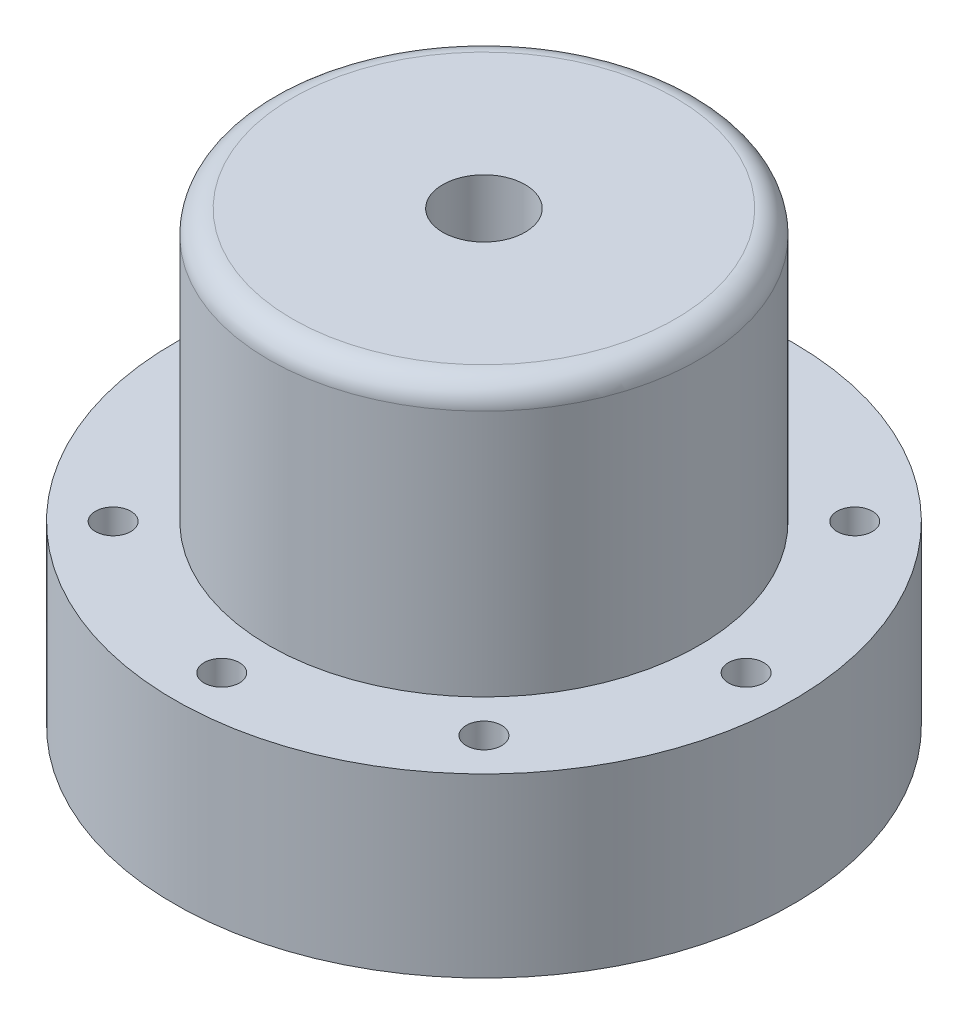
ISO-10303-21;
HEADER;
FILE_DESCRIPTION(('STEP AP214'),'2;1');
FILE_NAME('part.step','',(''),(''),'','','');
FILE_SCHEMA(('AUTOMOTIVE_DESIGN { 1 0 10303 214 1 1 1 1 }'));
ENDSEC;
DATA;
#1=APPLICATION_CONTEXT('core data for automotive mechanical design processes');
#2=APPLICATION_PROTOCOL_DEFINITION('international standard','automotive_design',2000,#1);
#3=PRODUCT_CONTEXT('',#1,'mechanical');
#4=PRODUCT('Part','Part','',(#3));
#5=PRODUCT_RELATED_PRODUCT_CATEGORY('part','',(#4));
#6=PRODUCT_DEFINITION_FORMATION('','',#4);
#7=PRODUCT_DEFINITION_CONTEXT('part definition',#1,'design');
#8=PRODUCT_DEFINITION('design','',#6,#7);
#9=PRODUCT_DEFINITION_SHAPE('','',#8);
#10=(LENGTH_UNIT() NAMED_UNIT(*) SI_UNIT(.MILLI.,.METRE.));
#11=(NAMED_UNIT(*) PLANE_ANGLE_UNIT() SI_UNIT($,.RADIAN.));
#12=(NAMED_UNIT(*) SI_UNIT($,.STERADIAN.) SOLID_ANGLE_UNIT());
#13=UNCERTAINTY_MEASURE_WITH_UNIT(LENGTH_MEASURE(1.E-05),#10,'distance_accuracy_value','');
#14=(GEOMETRIC_REPRESENTATION_CONTEXT(3) GLOBAL_UNCERTAINTY_ASSIGNED_CONTEXT((#13)) GLOBAL_UNIT_ASSIGNED_CONTEXT((#10,
#11,#12)) REPRESENTATION_CONTEXT('',''));
#15=CARTESIAN_POINT('',(0.,0.,0.));
#16=DIRECTION('',(0.,0.,1.));
#17=DIRECTION('',(1.,0.,0.));
#18=AXIS2_PLACEMENT_3D('',#15,#16,#17);
#19=CARTESIAN_POINT('',(0.,-5.,0.));
#20=DIRECTION('',(0.,-1.,0.));
#21=DIRECTION('',(0.,0.,-1.));
#22=AXIS2_PLACEMENT_3D('',#19,#20,#21);
#23=PLANE('',#22);
#24=CARTESIAN_POINT('',(0.,-5.,0.));
#25=DIRECTION('',(0.,-1.,0.));
#26=DIRECTION('',(0.,0.,-1.));
#27=AXIS2_PLACEMENT_3D('',#24,#25,#26);
#28=CIRCLE('',#27,13.25);
#29=CARTESIAN_POINT('',(0.,-5.,-13.25));
#30=VERTEX_POINT('',#29);
#31=EDGE_CURVE('E58',#30,#30,#28,.T.);
#32=ORIENTED_EDGE('',*,*,#31,.F.);
#33=EDGE_LOOP('',(#32));
#34=FACE_BOUND('',#33,.T.);
#35=CARTESIAN_POINT('',(0.,-5.,0.));
#36=DIRECTION('',(0.,-1.,0.));
#37=DIRECTION('',(0.,0.,-1.));
#38=AXIS2_PLACEMENT_3D('',#35,#36,#37);
#39=CIRCLE('',#38,19.25);
#40=CARTESIAN_POINT('',(0.,-5.,-19.25));
#41=VERTEX_POINT('',#40);
#42=EDGE_CURVE('E90',#41,#41,#39,.T.);
#43=ORIENTED_EDGE('',*,*,#42,.T.);
#44=EDGE_LOOP('',(#43));
#45=FACE_BOUND('',#44,.T.);
#46=ADVANCED_FACE('F33',(#34,#45),#23,.T.);
#47=CARTESIAN_POINT('',(0.,18.,0.));
#48=DIRECTION('',(0.,-1.,0.));
#49=DIRECTION('',(0.,0.,-1.));
#50=AXIS2_PLACEMENT_3D('',#47,#48,#49);
#51=CYLINDRICAL_SURFACE('',#50,18.25);
#52=CARTESIAN_POINT('',(0.,21.,0.));
#53=DIRECTION('',(0.,1.,0.));
#54=DIRECTION('',(0.,0.,1.));
#55=AXIS2_PLACEMENT_3D('',#52,#53,#54);
#56=CIRCLE('',#55,18.25);
#57=CARTESIAN_POINT('',(0.,21.,18.25));
#58=VERTEX_POINT('',#57);
#59=EDGE_CURVE('E10',#58,#58,#56,.F.);
#60=ORIENTED_EDGE('',*,*,#59,.T.);
#61=EDGE_LOOP('',(#60));
#62=FACE_BOUND('',#61,.T.);
#63=CARTESIAN_POINT('',(0.,0.,0.));
#64=DIRECTION('',(0.,1.,0.));
#65=DIRECTION('',(0.,0.,1.));
#66=AXIS2_PLACEMENT_3D('',#63,#64,#65);
#67=CIRCLE('',#66,18.25);
#68=CARTESIAN_POINT('',(0.,0.,18.25));
#69=VERTEX_POINT('',#68);
#70=EDGE_CURVE('E44',#69,#69,#67,.T.);
#71=ORIENTED_EDGE('',*,*,#70,.T.);
#72=EDGE_LOOP('',(#71));
#73=FACE_BOUND('',#72,.T.);
#74=ADVANCED_FACE('F166',(#62,#73),#51,.T.);
#75=CARTESIAN_POINT('',(0.,18.,0.));
#76=DIRECTION('',(0.,-1.,0.));
#77=DIRECTION('',(0.,0.,-1.));
#78=AXIS2_PLACEMENT_3D('',#75,#76,#77);
#79=CYLINDRICAL_SURFACE('',#78,13.25);
#80=CARTESIAN_POINT('',(0.,18.,0.));
#81=DIRECTION('',(0.,1.,0.));
#82=DIRECTION('',(0.,0.,1.));
#83=AXIS2_PLACEMENT_3D('',#80,#81,#82);
#84=CIRCLE('',#83,13.25);
#85=CARTESIAN_POINT('',(0.,18.,13.25));
#86=VERTEX_POINT('',#85);
#87=EDGE_CURVE('E51',#86,#86,#84,.T.);
#88=ORIENTED_EDGE('',*,*,#87,.T.);
#89=EDGE_LOOP('',(#88));
#90=FACE_BOUND('',#89,.T.);
#91=ORIENTED_EDGE('',*,*,#31,.T.);
#92=EDGE_LOOP('',(#91));
#93=FACE_BOUND('',#92,.T.);
#94=ADVANCED_FACE('F172',(#90,#93),#79,.F.);
#95=CARTESIAN_POINT('',(0.,0.,0.));
#96=DIRECTION('',(0.,-1.,0.));
#97=DIRECTION('',(0.,0.,-1.));
#98=AXIS2_PLACEMENT_3D('',#95,#96,#97);
#99=PLANE('',#98);
#100=CARTESIAN_POINT('',(-22.25,0.,0.));
#101=DIRECTION('',(0.,1.,0.));
#102=DIRECTION('',(-1.,0.,0.));
#103=AXIS2_PLACEMENT_3D('',#100,#101,#102);
#104=CIRCLE('',#103,1.5);
#105=CARTESIAN_POINT('',(-23.75,0.,0.));
#106=VERTEX_POINT('',#105);
#107=EDGE_CURVE('E67',#106,#106,#104,.T.);
#108=ORIENTED_EDGE('',*,*,#107,.F.);
#109=EDGE_LOOP('',(#108));
#110=FACE_BOUND('',#109,.T.);
#111=CARTESIAN_POINT('',(-15.7331258814006,0.,-15.7331258814008));
#112=DIRECTION('',(0.,1.,0.));
#113=DIRECTION('',(-0.707106781186544,0.,-0.707106781186551));
#114=AXIS2_PLACEMENT_3D('',#111,#112,#113);
#115=CIRCLE('',#114,1.5);
#116=CARTESIAN_POINT('',(-16.7937860531804,0.,-16.7937860531806));
#117=VERTEX_POINT('',#116);
#118=EDGE_CURVE('E75',#117,#117,#115,.T.);
#119=ORIENTED_EDGE('',*,*,#118,.F.);
#120=EDGE_LOOP('',(#119));
#121=FACE_BOUND('',#120,.T.);
#122=CARTESIAN_POINT('',(0.,0.,-22.25));
#123=DIRECTION('',(0.,1.,0.));
#124=DIRECTION('',(0.,0.,-1.));
#125=AXIS2_PLACEMENT_3D('',#122,#123,#124);
#126=CIRCLE('',#125,1.5);
#127=CARTESIAN_POINT('',(0.,0.,-23.75));
#128=VERTEX_POINT('',#127);
#129=EDGE_CURVE('E71',#128,#128,#126,.T.);
#130=ORIENTED_EDGE('',*,*,#129,.F.);
#131=EDGE_LOOP('',(#130));
#132=FACE_BOUND('',#131,.T.);
#133=CARTESIAN_POINT('',(15.7331258814008,0.,-15.7331258814005));
#134=DIRECTION('',(0.,1.,0.));
#135=DIRECTION('',(0.707106781186554,0.,-0.707106781186541));
#136=AXIS2_PLACEMENT_3D('',#133,#134,#135);
#137=CIRCLE('',#136,1.5);
#138=CARTESIAN_POINT('',(16.7937860531806,0.,-16.7937860531804));
#139=VERTEX_POINT('',#138);
#140=EDGE_CURVE('E68',#139,#139,#137,.T.);
#141=ORIENTED_EDGE('',*,*,#140,.F.);
#142=EDGE_LOOP('',(#141));
#143=FACE_BOUND('',#142,.T.);
#144=CARTESIAN_POINT('',(22.25,0.,2.32950203201339E-13));
#145=DIRECTION('',(0.,1.,0.));
#146=DIRECTION('',(1.,0.,0.));
#147=AXIS2_PLACEMENT_3D('',#144,#145,#146);
#148=CIRCLE('',#147,1.5);
#149=CARTESIAN_POINT('',(23.75,0.,2.48661869226133E-13));
#150=VERTEX_POINT('',#149);
#151=EDGE_CURVE('E72',#150,#150,#148,.T.);
#152=ORIENTED_EDGE('',*,*,#151,.F.);
#153=EDGE_LOOP('',(#152));
#154=FACE_BOUND('',#153,.T.);
#155=CARTESIAN_POINT('',(15.7331258814005,0.,15.7331258814009));
#156=DIRECTION('',(0.,1.,0.));
#157=DIRECTION('',(0.707106781186539,0.,0.707106781186556));
#158=AXIS2_PLACEMENT_3D('',#155,#156,#157);
#159=CIRCLE('',#158,1.5);
#160=CARTESIAN_POINT('',(16.7937860531803,0.,16.7937860531807));
#161=VERTEX_POINT('',#160);
#162=EDGE_CURVE('E54',#161,#161,#159,.T.);
#163=ORIENTED_EDGE('',*,*,#162,.F.);
#164=EDGE_LOOP('',(#163));
#165=FACE_BOUND('',#164,.T.);
#166=CARTESIAN_POINT('',(-15.7331258814007,0.,15.7331258814007));
#167=DIRECTION('',(0.,1.,0.));
#168=DIRECTION('',(-0.707106781186549,0.,0.707106781186546));
#169=AXIS2_PLACEMENT_3D('',#166,#167,#168);
#170=CIRCLE('',#169,1.5);
#171=CARTESIAN_POINT('',(-16.7937860531805,0.,16.7937860531805));
#172=VERTEX_POINT('',#171);
#173=EDGE_CURVE('E64',#172,#172,#170,.T.);
#174=ORIENTED_EDGE('',*,*,#173,.F.);
#175=EDGE_LOOP('',(#174));
#176=FACE_BOUND('',#175,.T.);
#177=CARTESIAN_POINT('',(0.,0.,22.25));
#178=DIRECTION('',(0.,1.,0.));
#179=DIRECTION('',(0.,0.,1.));
#180=AXIS2_PLACEMENT_3D('',#177,#178,#179);
#181=CIRCLE('',#180,1.5);
#182=CARTESIAN_POINT('',(0.,0.,23.75));
#183=VERTEX_POINT('',#182);
#184=EDGE_CURVE('E61',#183,#183,#181,.T.);
#185=ORIENTED_EDGE('',*,*,#184,.F.);
#186=EDGE_LOOP('',(#185));
#187=FACE_BOUND('',#186,.T.);
#188=ORIENTED_EDGE('',*,*,#70,.F.);
#189=EDGE_LOOP('',(#188));
#190=FACE_BOUND('',#189,.T.);
#191=CARTESIAN_POINT('',(0.,0.,0.));
#192=DIRECTION('',(0.,-1.,0.));
#193=DIRECTION('',(0.,0.,-1.));
#194=AXIS2_PLACEMENT_3D('',#191,#192,#193);
#195=CIRCLE('',#194,26.25);
#196=CARTESIAN_POINT('',(0.,0.,-26.25));
#197=VERTEX_POINT('',#196);
#198=EDGE_CURVE('E48',#197,#197,#195,.T.);
#199=ORIENTED_EDGE('',*,*,#198,.F.);
#200=EDGE_LOOP('',(#199));
#201=FACE_BOUND('',#200,.T.);
#202=ADVANCED_FACE('F179',(#110,#121,#132,#143,#154,#165,#176,#187,#190,#201),#99,.F.);
#203=CARTESIAN_POINT('',(0.,-5.,0.));
#204=DIRECTION('',(0.,1.,0.));
#205=DIRECTION('',(0.,0.,1.));
#206=AXIS2_PLACEMENT_3D('',#203,#204,#205);
#207=CYLINDRICAL_SURFACE('',#206,26.25);
#208=ORIENTED_EDGE('',*,*,#198,.T.);
#209=EDGE_LOOP('',(#208));
#210=FACE_BOUND('',#209,.T.);
#211=CARTESIAN_POINT('',(0.,-15.,0.));
#212=DIRECTION('',(0.,-1.,0.));
#213=DIRECTION('',(0.,0.,-1.));
#214=AXIS2_PLACEMENT_3D('',#211,#212,#213);
#215=CIRCLE('',#214,26.25);
#216=CARTESIAN_POINT('',(0.,-15.,-26.25));
#217=VERTEX_POINT('',#216);
#218=EDGE_CURVE('E105',#217,#217,#215,.T.);
#219=ORIENTED_EDGE('',*,*,#218,.F.);
#220=EDGE_LOOP('',(#219));
#221=FACE_BOUND('',#220,.T.);
#222=ADVANCED_FACE('F182',(#210,#221),#207,.T.);
#223=CARTESIAN_POINT('',(0.,-5.001,22.25));
#224=DIRECTION('',(0.,1.,0.));
#225=DIRECTION('',(0.,0.,1.));
#226=AXIS2_PLACEMENT_3D('',#223,#224,#225);
#227=CYLINDRICAL_SURFACE('',#226,1.5);
#228=ORIENTED_EDGE('',*,*,#184,.T.);
#229=EDGE_LOOP('',(#228));
#230=FACE_BOUND('',#229,.T.);
#231=CARTESIAN_POINT('',(0.,-15.,22.25));
#232=DIRECTION('',(0.,-1.,0.));
#233=DIRECTION('',(0.,0.,-1.));
#234=AXIS2_PLACEMENT_3D('',#231,#232,#233);
#235=CIRCLE('',#234,1.5);
#236=CARTESIAN_POINT('',(0.,-15.,20.75));
#237=VERTEX_POINT('',#236);
#238=EDGE_CURVE('E108',#237,#237,#235,.F.);
#239=ORIENTED_EDGE('',*,*,#238,.F.);
#240=EDGE_LOOP('',(#239));
#241=FACE_BOUND('',#240,.T.);
#242=ADVANCED_FACE('F177',(#230,#241),#227,.F.);
#243=CARTESIAN_POINT('',(-15.7331258814007,-5.001,15.7331258814007));
#244=DIRECTION('',(0.,1.,0.));
#245=DIRECTION('',(0.,0.,1.));
#246=AXIS2_PLACEMENT_3D('',#243,#244,#245);
#247=CYLINDRICAL_SURFACE('',#246,1.5);
#248=ORIENTED_EDGE('',*,*,#173,.T.);
#249=EDGE_LOOP('',(#248));
#250=FACE_BOUND('',#249,.T.);
#251=CARTESIAN_POINT('',(-15.7331258814007,-15.,15.7331258814007));
#252=DIRECTION('',(0.,-1.,0.));
#253=DIRECTION('',(0.,0.,-1.));
#254=AXIS2_PLACEMENT_3D('',#251,#252,#253);
#255=CIRCLE('',#254,1.5);
#256=CARTESIAN_POINT('',(-15.7331258814007,-15.,14.2331258814007));
#257=VERTEX_POINT('',#256);
#258=EDGE_CURVE('E102',#257,#257,#255,.F.);
#259=ORIENTED_EDGE('',*,*,#258,.F.);
#260=EDGE_LOOP('',(#259));
#261=FACE_BOUND('',#260,.T.);
#262=ADVANCED_FACE('F211',(#250,#261),#247,.F.);
#263=CARTESIAN_POINT('',(15.7331258814005,-5.001,15.7331258814009));
#264=DIRECTION('',(0.,1.,0.));
#265=DIRECTION('',(0.,0.,1.));
#266=AXIS2_PLACEMENT_3D('',#263,#264,#265);
#267=CYLINDRICAL_SURFACE('',#266,1.5);
#268=ORIENTED_EDGE('',*,*,#162,.T.);
#269=EDGE_LOOP('',(#268));
#270=FACE_BOUND('',#269,.T.);
#271=CARTESIAN_POINT('',(15.7331258814005,-15.,15.7331258814009));
#272=DIRECTION('',(0.,-1.,0.));
#273=DIRECTION('',(0.,0.,-1.));
#274=AXIS2_PLACEMENT_3D('',#271,#272,#273);
#275=CIRCLE('',#274,1.5);
#276=CARTESIAN_POINT('',(15.7331258814005,-15.,14.2331258814009));
#277=VERTEX_POINT('',#276);
#278=EDGE_CURVE('E111',#277,#277,#275,.F.);
#279=ORIENTED_EDGE('',*,*,#278,.F.);
#280=EDGE_LOOP('',(#279));
#281=FACE_BOUND('',#280,.T.);
#282=ADVANCED_FACE('F218',(#270,#281),#267,.F.);
#283=CARTESIAN_POINT('',(22.25,-5.001,2.32950203201339E-13));
#284=DIRECTION('',(0.,1.,0.));
#285=DIRECTION('',(0.,0.,1.));
#286=AXIS2_PLACEMENT_3D('',#283,#284,#285);
#287=CYLINDRICAL_SURFACE('',#286,1.5);
#288=ORIENTED_EDGE('',*,*,#151,.T.);
#289=EDGE_LOOP('',(#288));
#290=FACE_BOUND('',#289,.T.);
#291=CARTESIAN_POINT('',(22.25,-15.,2.32950203201339E-13));
#292=DIRECTION('',(0.,-1.,0.));
#293=DIRECTION('',(0.,0.,-1.));
#294=AXIS2_PLACEMENT_3D('',#291,#292,#293);
#295=CIRCLE('',#294,1.5);
#296=CARTESIAN_POINT('',(22.25,-15.,-1.49999999999977));
#297=VERTEX_POINT('',#296);
#298=EDGE_CURVE('E99',#297,#297,#295,.F.);
#299=ORIENTED_EDGE('',*,*,#298,.F.);
#300=EDGE_LOOP('',(#299));
#301=FACE_BOUND('',#300,.T.);
#302=ADVANCED_FACE('F225',(#290,#301),#287,.F.);
#303=CARTESIAN_POINT('',(15.7331258814008,-5.001,-15.7331258814005));
#304=DIRECTION('',(0.,1.,0.));
#305=DIRECTION('',(0.,0.,1.));
#306=AXIS2_PLACEMENT_3D('',#303,#304,#305);
#307=CYLINDRICAL_SURFACE('',#306,1.5);
#308=ORIENTED_EDGE('',*,*,#140,.T.);
#309=EDGE_LOOP('',(#308));
#310=FACE_BOUND('',#309,.T.);
#311=CARTESIAN_POINT('',(15.7331258814008,-15.,-15.7331258814005));
#312=DIRECTION('',(0.,-1.,0.));
#313=DIRECTION('',(0.,0.,-1.));
#314=AXIS2_PLACEMENT_3D('',#311,#312,#313);
#315=CIRCLE('',#314,1.5);
#316=CARTESIAN_POINT('',(15.7331258814008,-15.,-17.2331258814005));
#317=VERTEX_POINT('',#316);
#318=EDGE_CURVE('E114',#317,#317,#315,.F.);
#319=ORIENTED_EDGE('',*,*,#318,.F.);
#320=EDGE_LOOP('',(#319));
#321=FACE_BOUND('',#320,.T.);
#322=ADVANCED_FACE('F232',(#310,#321),#307,.F.);
#323=CARTESIAN_POINT('',(0.,-5.001,-22.25));
#324=DIRECTION('',(0.,1.,0.));
#325=DIRECTION('',(0.,0.,1.));
#326=AXIS2_PLACEMENT_3D('',#323,#324,#325);
#327=CYLINDRICAL_SURFACE('',#326,1.5);
#328=ORIENTED_EDGE('',*,*,#129,.T.);
#329=EDGE_LOOP('',(#328));
#330=FACE_BOUND('',#329,.T.);
#331=CARTESIAN_POINT('',(0.,-15.,-22.25));
#332=DIRECTION('',(0.,-1.,0.));
#333=DIRECTION('',(0.,0.,-1.));
#334=AXIS2_PLACEMENT_3D('',#331,#332,#333);
#335=CIRCLE('',#334,1.5);
#336=CARTESIAN_POINT('',(0.,-15.,-23.75));
#337=VERTEX_POINT('',#336);
#338=EDGE_CURVE('E96',#337,#337,#335,.F.);
#339=ORIENTED_EDGE('',*,*,#338,.F.);
#340=EDGE_LOOP('',(#339));
#341=FACE_BOUND('',#340,.T.);
#342=ADVANCED_FACE('F161',(#330,#341),#327,.F.);
#343=CARTESIAN_POINT('',(-15.7331258814006,-5.001,-15.7331258814008));
#344=DIRECTION('',(0.,1.,0.));
#345=DIRECTION('',(0.,0.,1.));
#346=AXIS2_PLACEMENT_3D('',#343,#344,#345);
#347=CYLINDRICAL_SURFACE('',#346,1.5);
#348=ORIENTED_EDGE('',*,*,#118,.T.);
#349=EDGE_LOOP('',(#348));
#350=FACE_BOUND('',#349,.T.);
#351=CARTESIAN_POINT('',(-15.7331258814006,-15.,-15.7331258814008));
#352=DIRECTION('',(0.,-1.,0.));
#353=DIRECTION('',(0.,0.,-1.));
#354=AXIS2_PLACEMENT_3D('',#351,#352,#353);
#355=CIRCLE('',#354,1.5);
#356=CARTESIAN_POINT('',(-15.7331258814006,-15.,-17.2331258814008));
#357=VERTEX_POINT('',#356);
#358=EDGE_CURVE('E117',#357,#357,#355,.F.);
#359=ORIENTED_EDGE('',*,*,#358,.F.);
#360=EDGE_LOOP('',(#359));
#361=FACE_BOUND('',#360,.T.);
#362=ADVANCED_FACE('F151',(#350,#361),#347,.F.);
#363=CARTESIAN_POINT('',(-22.25,-5.001,0.));
#364=DIRECTION('',(0.,1.,0.));
#365=DIRECTION('',(0.,0.,1.));
#366=AXIS2_PLACEMENT_3D('',#363,#364,#365);
#367=CYLINDRICAL_SURFACE('',#366,1.5);
#368=ORIENTED_EDGE('',*,*,#107,.T.);
#369=EDGE_LOOP('',(#368));
#370=FACE_BOUND('',#369,.T.);
#371=CARTESIAN_POINT('',(-22.25,-15.,0.));
#372=DIRECTION('',(0.,-1.,0.));
#373=DIRECTION('',(0.,0.,-1.));
#374=AXIS2_PLACEMENT_3D('',#371,#372,#373);
#375=CIRCLE('',#374,1.5);
#376=CARTESIAN_POINT('',(-22.25,-15.,-1.50000000000008));
#377=VERTEX_POINT('',#376);
#378=EDGE_CURVE('E87',#377,#377,#375,.F.);
#379=ORIENTED_EDGE('',*,*,#378,.F.);
#380=EDGE_LOOP('',(#379));
#381=FACE_BOUND('',#380,.T.);
#382=ADVANCED_FACE('F148',(#370,#381),#367,.F.);
#383=CARTESIAN_POINT('',(0.,18.,0.));
#384=DIRECTION('',(0.,1.,0.));
#385=DIRECTION('',(0.,0.,1.));
#386=AXIS2_PLACEMENT_3D('',#383,#384,#385);
#387=PLANE('',#386);
#388=CARTESIAN_POINT('',(0.,18.,0.));
#389=DIRECTION('',(0.,1.,0.));
#390=DIRECTION('',(0.,0.,1.));
#391=AXIS2_PLACEMENT_3D('',#388,#389,#390);
#392=CIRCLE('',#391,3.5);
#393=CARTESIAN_POINT('',(0.,18.,3.5));
#394=VERTEX_POINT('',#393);
#395=EDGE_CURVE('E84',#394,#394,#392,.T.);
#396=ORIENTED_EDGE('',*,*,#395,.T.);
#397=EDGE_LOOP('',(#396));
#398=FACE_BOUND('',#397,.T.);
#399=ORIENTED_EDGE('',*,*,#87,.F.);
#400=EDGE_LOOP('',(#399));
#401=FACE_BOUND('',#400,.T.);
#402=ADVANCED_FACE('F150',(#398,#401),#387,.F.);
#403=CARTESIAN_POINT('',(0.,23.,0.));
#404=DIRECTION('',(0.,1.,0.));
#405=DIRECTION('',(0.,0.,1.));
#406=AXIS2_PLACEMENT_3D('',#403,#404,#405);
#407=PLANE('',#406);
#408=CARTESIAN_POINT('',(0.,23.,0.));
#409=DIRECTION('',(0.,1.,0.));
#410=DIRECTION('',(0.,0.,1.));
#411=AXIS2_PLACEMENT_3D('',#408,#409,#410);
#412=CIRCLE('',#411,16.25);
#413=CARTESIAN_POINT('',(0.,23.,16.25));
#414=VERTEX_POINT('',#413);
#415=EDGE_CURVE('E40',#414,#414,#412,.T.);
#416=ORIENTED_EDGE('',*,*,#415,.T.);
#417=EDGE_LOOP('',(#416));
#418=FACE_BOUND('',#417,.T.);
#419=CARTESIAN_POINT('',(0.,23.,0.));
#420=DIRECTION('',(0.,1.,0.));
#421=DIRECTION('',(0.,0.,1.));
#422=AXIS2_PLACEMENT_3D('',#419,#420,#421);
#423=CIRCLE('',#422,3.5);
#424=CARTESIAN_POINT('',(0.,23.,3.5));
#425=VERTEX_POINT('',#424);
#426=EDGE_CURVE('E55',#425,#425,#423,.T.);
#427=ORIENTED_EDGE('',*,*,#426,.F.);
#428=EDGE_LOOP('',(#427));
#429=FACE_BOUND('',#428,.T.);
#430=ADVANCED_FACE('F158',(#418,#429),#407,.T.);
#431=CARTESIAN_POINT('',(0.,23.,0.));
#432=DIRECTION('',(0.,-1.,0.));
#433=DIRECTION('',(0.,0.,-1.));
#434=AXIS2_PLACEMENT_3D('',#431,#432,#433);
#435=CYLINDRICAL_SURFACE('',#434,3.5);
#436=ORIENTED_EDGE('',*,*,#426,.T.);
#437=EDGE_LOOP('',(#436));
#438=FACE_BOUND('',#437,.T.);
#439=ORIENTED_EDGE('',*,*,#395,.F.);
#440=EDGE_LOOP('',(#439));
#441=FACE_BOUND('',#440,.T.);
#442=ADVANCED_FACE('F267',(#438,#441),#435,.F.);
#443=CARTESIAN_POINT('',(0.,-15.,0.));
#444=DIRECTION('',(0.,1.,0.));
#445=DIRECTION('',(0.,0.,1.));
#446=AXIS2_PLACEMENT_3D('',#443,#444,#445);
#447=CYLINDRICAL_SURFACE('',#446,19.25);
#448=CARTESIAN_POINT('',(0.,-15.,0.));
#449=DIRECTION('',(0.,-1.,0.));
#450=DIRECTION('',(0.,0.,-1.));
#451=AXIS2_PLACEMENT_3D('',#448,#449,#450);
#452=CIRCLE('',#451,19.25);
#453=CARTESIAN_POINT('',(0.,-15.,-19.25));
#454=VERTEX_POINT('',#453);
#455=EDGE_CURVE('E93',#454,#454,#452,.T.);
#456=ORIENTED_EDGE('',*,*,#455,.T.);
#457=EDGE_LOOP('',(#456));
#458=FACE_BOUND('',#457,.T.);
#459=ORIENTED_EDGE('',*,*,#42,.F.);
#460=EDGE_LOOP('',(#459));
#461=FACE_BOUND('',#460,.T.);
#462=ADVANCED_FACE('F123',(#458,#461),#447,.F.);
#463=CARTESIAN_POINT('',(0.,-15.,0.));
#464=DIRECTION('',(0.,-1.,0.));
#465=DIRECTION('',(0.,0.,-1.));
#466=AXIS2_PLACEMENT_3D('',#463,#464,#465);
#467=PLANE('',#466);
#468=ORIENTED_EDGE('',*,*,#455,.F.);
#469=EDGE_LOOP('',(#468));
#470=FACE_BOUND('',#469,.T.);
#471=ORIENTED_EDGE('',*,*,#358,.T.);
#472=EDGE_LOOP('',(#471));
#473=FACE_BOUND('',#472,.T.);
#474=ORIENTED_EDGE('',*,*,#318,.T.);
#475=EDGE_LOOP('',(#474));
#476=FACE_BOUND('',#475,.T.);
#477=ORIENTED_EDGE('',*,*,#278,.T.);
#478=EDGE_LOOP('',(#477));
#479=FACE_BOUND('',#478,.T.);
#480=ORIENTED_EDGE('',*,*,#238,.T.);
#481=EDGE_LOOP('',(#480));
#482=FACE_BOUND('',#481,.T.);
#483=ORIENTED_EDGE('',*,*,#218,.T.);
#484=EDGE_LOOP('',(#483));
#485=FACE_BOUND('',#484,.T.);
#486=ORIENTED_EDGE('',*,*,#258,.T.);
#487=EDGE_LOOP('',(#486));
#488=FACE_BOUND('',#487,.T.);
#489=ORIENTED_EDGE('',*,*,#298,.T.);
#490=EDGE_LOOP('',(#489));
#491=FACE_BOUND('',#490,.T.);
#492=ORIENTED_EDGE('',*,*,#338,.T.);
#493=EDGE_LOOP('',(#492));
#494=FACE_BOUND('',#493,.T.);
#495=ORIENTED_EDGE('',*,*,#378,.T.);
#496=EDGE_LOOP('',(#495));
#497=FACE_BOUND('',#496,.T.);
#498=ADVANCED_FACE('F126',(#470,#473,#476,#479,#482,#485,#488,#491,#494,#497),#467,.T.);
#499=CARTESIAN_POINT('',(0.,21.,0.));
#500=DIRECTION('',(0.,1.,0.));
#501=DIRECTION('',(0.,0.,1.));
#502=AXIS2_PLACEMENT_3D('',#499,#500,#501);
#503=TOROIDAL_SURFACE('',#502,16.25,2.);
#504=ORIENTED_EDGE('',*,*,#59,.F.);
#505=EDGE_LOOP('',(#504));
#506=FACE_BOUND('',#505,.T.);
#507=ORIENTED_EDGE('',*,*,#415,.F.);
#508=EDGE_LOOP('',(#507));
#509=FACE_BOUND('',#508,.T.);
#510=ADVANCED_FACE('F35',(#506,#509),#503,.T.);
#511=CLOSED_SHELL('',(#46,#74,#94,#202,#222,#242,#262,#282,#302,#322,#342,#362,#382,#402,#430,
#442,#462,#498,#510));
#512=MANIFOLD_SOLID_BREP('B2',#511);
#513=ADVANCED_BREP_SHAPE_REPRESENTATION('',(#18,#512),#14);
#514=SHAPE_DEFINITION_REPRESENTATION(#9,#513);
ENDSEC;
END-ISO-10303-21;
